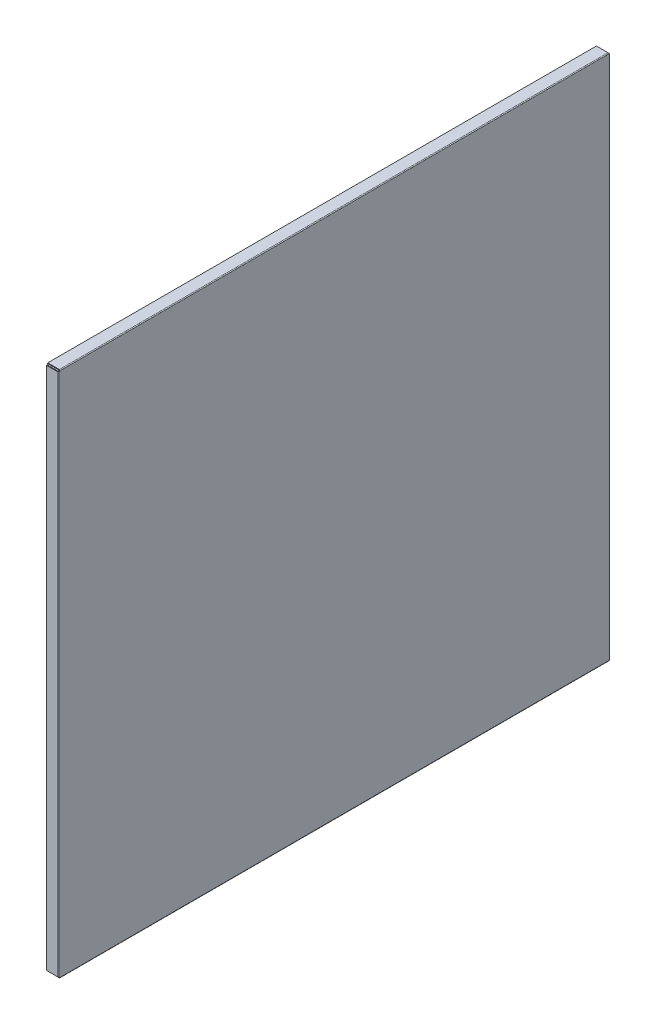
ISO-10303-21;
HEADER;
FILE_DESCRIPTION(('STEP AP214'),'2;1');
FILE_NAME('part.step','',(''),(''),'','','');
FILE_SCHEMA(('AUTOMOTIVE_DESIGN { 1 0 10303 214 1 1 1 1 }'));
ENDSEC;
DATA;
#1=APPLICATION_CONTEXT('core data for automotive mechanical design processes');
#2=APPLICATION_PROTOCOL_DEFINITION('international standard','automotive_design',2000,#1);
#3=PRODUCT_CONTEXT('',#1,'mechanical');
#4=PRODUCT('Part','Part','',(#3));
#5=PRODUCT_RELATED_PRODUCT_CATEGORY('part','',(#4));
#6=PRODUCT_DEFINITION_FORMATION('','',#4);
#7=PRODUCT_DEFINITION_CONTEXT('part definition',#1,'design');
#8=PRODUCT_DEFINITION('design','',#6,#7);
#9=PRODUCT_DEFINITION_SHAPE('','',#8);
#10=(LENGTH_UNIT() NAMED_UNIT(*) SI_UNIT(.MILLI.,.METRE.));
#11=(NAMED_UNIT(*) PLANE_ANGLE_UNIT() SI_UNIT($,.RADIAN.));
#12=(NAMED_UNIT(*) SI_UNIT($,.STERADIAN.) SOLID_ANGLE_UNIT());
#13=UNCERTAINTY_MEASURE_WITH_UNIT(LENGTH_MEASURE(1.E-05),#10,'distance_accuracy_value','');
#14=(GEOMETRIC_REPRESENTATION_CONTEXT(3) GLOBAL_UNCERTAINTY_ASSIGNED_CONTEXT((#13)) GLOBAL_UNIT_ASSIGNED_CONTEXT((#10,
#11,#12)) REPRESENTATION_CONTEXT('',''));
#15=CARTESIAN_POINT('',(0.,0.,0.));
#16=DIRECTION('',(0.,0.,1.));
#17=DIRECTION('',(1.,0.,0.));
#18=AXIS2_PLACEMENT_3D('',#15,#16,#17);
#19=CARTESIAN_POINT('',(599.,0.,0.));
#20=DIRECTION('',(-1.,0.,0.));
#21=DIRECTION('',(0.,0.,1.));
#22=AXIS2_PLACEMENT_3D('',#19,#20,#21);
#23=PLANE('',#22);
#24=DIRECTION('',(0.,1.,0.));
#25=VECTOR('',#24,1.);
#26=CARTESIAN_POINT('',(599.,-359.000000000004,-41.));
#27=LINE('',#26,#25);
#28=CARTESIAN_POINT('',(599.,-40.7071067811904,-41.));
#29=VERTEX_POINT('',#28);
#30=CARTESIAN_POINT('',(599.,-40.0000000000037,-41.));
#31=VERTEX_POINT('',#30);
#32=EDGE_CURVE('E433',#29,#31,#27,.T.);
#33=ORIENTED_EDGE('',*,*,#32,.T.);
#34=DIRECTION('',(0.,0.,-1.));
#35=VECTOR('',#34,1.);
#36=CARTESIAN_POINT('',(599.,-40.0000000000037,-375.));
#37=LINE('',#36,#35);
#38=CARTESIAN_POINT('',(599.,-40.0000000000037,-41.7071067811866));
#39=VERTEX_POINT('',#38);
#40=EDGE_CURVE('E571',#31,#39,#37,.T.);
#41=ORIENTED_EDGE('',*,*,#40,.T.);
#42=DIRECTION('',(0.,0.,-1.));
#43=VECTOR('',#42,1.);
#44=CARTESIAN_POINT('',(599.,-40.0000000000037,0.));
#45=LINE('',#44,#43);
#46=CARTESIAN_POINT('',(599.,-40.0000000000037,-708.292893218813));
#47=VERTEX_POINT('',#46);
#48=EDGE_CURVE('E565',#47,#39,#45,.F.);
#49=ORIENTED_EDGE('',*,*,#48,.F.);
#50=CARTESIAN_POINT('',(599.,-40.0000000000037,-709.));
#51=VERTEX_POINT('',#50);
#52=EDGE_CURVE('E426',#47,#51,#37,.T.);
#53=ORIENTED_EDGE('',*,*,#52,.T.);
#54=DIRECTION('',(0.,-1.,0.));
#55=VECTOR('',#54,1.);
#56=CARTESIAN_POINT('',(599.,-359.000000000004,-709.));
#57=LINE('',#56,#55);
#58=CARTESIAN_POINT('',(599.,-40.7071067811904,-709.));
#59=VERTEX_POINT('',#58);
#60=EDGE_CURVE('E814',#51,#59,#57,.T.);
#61=ORIENTED_EDGE('',*,*,#60,.T.);
#62=DIRECTION('',(0.,-1.,0.));
#63=VECTOR('',#62,1.);
#64=CARTESIAN_POINT('',(599.,1.22991894446756E-13,-709.));
#65=LINE('',#64,#63);
#66=CARTESIAN_POINT('',(599.,-677.292893218817,-709.));
#67=VERTEX_POINT('',#66);
#68=EDGE_CURVE('E779',#67,#59,#65,.F.);
#69=ORIENTED_EDGE('',*,*,#68,.F.);
#70=CARTESIAN_POINT('',(599.,-678.000000000004,-709.));
#71=VERTEX_POINT('',#70);
#72=EDGE_CURVE('E811',#67,#71,#57,.T.);
#73=ORIENTED_EDGE('',*,*,#72,.T.);
#74=DIRECTION('',(0.,0.,1.));
#75=VECTOR('',#74,1.);
#76=CARTESIAN_POINT('',(599.,-678.000000000004,-375.));
#77=LINE('',#76,#75);
#78=CARTESIAN_POINT('',(599.,-678.000000000004,-708.292893218813));
#79=VERTEX_POINT('',#78);
#80=EDGE_CURVE('E910',#71,#79,#77,.T.);
#81=ORIENTED_EDGE('',*,*,#80,.T.);
#82=DIRECTION('',(0.,0.,1.));
#83=VECTOR('',#82,1.);
#84=CARTESIAN_POINT('',(599.,-678.000000000004,-1.12347941894905E-13));
#85=LINE('',#84,#83);
#86=CARTESIAN_POINT('',(599.,-678.000000000004,-41.7071067811866));
#87=VERTEX_POINT('',#86);
#88=EDGE_CURVE('E701',#87,#79,#85,.F.);
#89=ORIENTED_EDGE('',*,*,#88,.F.);
#90=CARTESIAN_POINT('',(599.,-678.000000000004,-41.));
#91=VERTEX_POINT('',#90);
#92=EDGE_CURVE('E919',#87,#91,#77,.T.);
#93=ORIENTED_EDGE('',*,*,#92,.T.);
#94=CARTESIAN_POINT('',(599.,-677.292893218817,-41.));
#95=VERTEX_POINT('',#94);
#96=EDGE_CURVE('E1005',#91,#95,#27,.T.);
#97=ORIENTED_EDGE('',*,*,#96,.T.);
#98=DIRECTION('',(0.,1.,0.));
#99=VECTOR('',#98,1.);
#100=CARTESIAN_POINT('',(599.,0.,-41.));
#101=LINE('',#100,#99);
#102=EDGE_CURVE('E739',#29,#95,#101,.F.);
#103=ORIENTED_EDGE('',*,*,#102,.F.);
#104=EDGE_LOOP('',(#33,#41,#49,#53,#61,#69,#73,#81,#89,#93,#97,#103));
#105=FACE_BOUND('',#104,.T.);
#106=ADVANCED_FACE('F410',(#105),#23,.T.);
#107=CARTESIAN_POINT('',(600.,0.,0.));
#108=DIRECTION('',(-1.,0.,0.));
#109=DIRECTION('',(0.,0.,1.));
#110=AXIS2_PLACEMENT_3D('',#107,#108,#109);
#111=PLANE('',#110);
#112=DIRECTION('',(0.,0.,-1.));
#113=VECTOR('',#112,1.);
#114=CARTESIAN_POINT('',(600.,-40.0000000000037,-709.));
#115=LINE('',#114,#113);
#116=CARTESIAN_POINT('',(600.,-40.0000000000037,-41.0000000000001));
#117=VERTEX_POINT('',#116);
#118=CARTESIAN_POINT('',(600.,-40.0000000000038,-709.));
#119=VERTEX_POINT('',#118);
#120=EDGE_CURVE('E661',#117,#119,#115,.T.);
#121=ORIENTED_EDGE('',*,*,#120,.F.);
#122=DIRECTION('',(0.,1.,0.));
#123=VECTOR('',#122,1.);
#124=CARTESIAN_POINT('',(600.,-40.0000000000037,-41.));
#125=LINE('',#124,#123);
#126=CARTESIAN_POINT('',(600.,-678.000000000004,-41.));
#127=VERTEX_POINT('',#126);
#128=EDGE_CURVE('E1071',#127,#117,#125,.T.);
#129=ORIENTED_EDGE('',*,*,#128,.F.);
#130=DIRECTION('',(0.,0.,1.));
#131=VECTOR('',#130,1.);
#132=CARTESIAN_POINT('',(600.,-678.000000000004,-40.9999999999999));
#133=LINE('',#132,#131);
#134=CARTESIAN_POINT('',(600.,-678.000000000004,-709.));
#135=VERTEX_POINT('',#134);
#136=EDGE_CURVE('E921',#135,#127,#133,.T.);
#137=ORIENTED_EDGE('',*,*,#136,.F.);
#138=DIRECTION('',(0.,-1.,0.));
#139=VECTOR('',#138,1.);
#140=CARTESIAN_POINT('',(600.,-678.000000000004,-709.));
#141=LINE('',#140,#139);
#142=EDGE_CURVE('E419',#119,#135,#141,.T.);
#143=ORIENTED_EDGE('',*,*,#142,.F.);
#144=EDGE_LOOP('',(#121,#129,#137,#143));
#145=FACE_BOUND('',#144,.T.);
#146=ADVANCED_FACE('F412',(#145),#111,.F.);
#147=CARTESIAN_POINT('',(599.,-40.7071067811904,-709.));
#148=CARTESIAN_POINT('',(599.,-40.7071067811904,-709.333333333333));
#149=CARTESIAN_POINT('',(599.,-40.7071067811904,-709.666666666667));
#150=CARTESIAN_POINT('',(599.,-40.7071067811904,-710.));
#151=CARTESIAN_POINT('',(599.,-40.5892556509926,-709.));
#152=CARTESIAN_POINT('',(599.0872664626,-40.5892556509926,-709.333333333333));
#153=CARTESIAN_POINT('',(599.174532925199,-40.5892556509926,-709.666666666667));
#154=CARTESIAN_POINT('',(599.261799387799,-40.5892556509926,-710.));
#155=CARTESIAN_POINT('',(599.,-40.4714045207948,-709.));
#156=CARTESIAN_POINT('',(599.173995552921,-40.4714045207948,-709.29740896787));
#157=CARTESIAN_POINT('',(599.347991105842,-40.4714045207948,-709.59481793574));
#158=CARTESIAN_POINT('',(599.521986658763,-40.4714045207949,-709.89222690361));
#159=CARTESIAN_POINT('',(599.,-40.2357022603993,-709.));
#160=CARTESIAN_POINT('',(599.29740896787,-40.2357022603993,-709.173995552921));
#161=CARTESIAN_POINT('',(599.59481793574,-40.2357022603993,-709.347991105842));
#162=CARTESIAN_POINT('',(599.89222690361,-40.2357022603993,-709.521986658763));
#163=CARTESIAN_POINT('',(599.,-40.1178511302015,-709.));
#164=CARTESIAN_POINT('',(599.333333333333,-40.1178511302015,-709.0872664626));
#165=CARTESIAN_POINT('',(599.666666666667,-40.1178511302016,-709.1745329252));
#166=CARTESIAN_POINT('',(600.,-40.1178511302016,-709.261799387799));
#167=CARTESIAN_POINT('',(599.,-40.0000000000038,-709.));
#168=CARTESIAN_POINT('',(599.333333333333,-40.0000000000038,-709.));
#169=CARTESIAN_POINT('',(599.666666666667,-40.0000000000038,-709.));
#170=CARTESIAN_POINT('',(600.,-40.0000000000038,-709.));
#171=B_SPLINE_SURFACE_WITH_KNOTS('',3,3,((#147,#148,#149,#150),(#151,#152,#153,#154),(#155,#156,
#157,#158),(#159,#160,#161,#162),(#163,#164,#165,#166),(#167,#168,#169,#170)),.UNSPECIFIED.,.F.,
.F.,.F.,(4,2,4),(4,4),(0.,0.5,1.),(0.,1.),.UNSPECIFIED.);
#172=DIRECTION('',(-1.,0.,0.));
#173=VECTOR('',#172,1.);
#174=CARTESIAN_POINT('',(599.5,-40.0000000000038,-709.));
#175=LINE('',#174,#173);
#176=EDGE_CURVE('E578',#119,#51,#175,.T.);
#177=CARTESIAN_POINT('',(600.,-40.0000000000038,-709.));
#178=CARTESIAN_POINT('',(600.,-40.1178511302016,-709.261799387799));
#179=CARTESIAN_POINT('',(599.89222690361,-40.2357022603993,-709.521986658763));
#180=CARTESIAN_POINT('',(599.521986658763,-40.4714045207949,-709.89222690361));
#181=CARTESIAN_POINT('',(599.261799387799,-40.5892556509926,-710.));
#182=CARTESIAN_POINT('',(599.,-40.7071067811904,-710.));
#183=B_SPLINE_CURVE_WITH_KNOTS('',3,(#177,#178,#179,#180,#181,#182),.UNSPECIFIED.,.F.,.F.,(4,2,
4),(0.,0.5,1.),.UNSPECIFIED.);
#184=CARTESIAN_POINT('',(599.,-40.7071067811904,-710.));
#185=VERTEX_POINT('',#184);
#186=EDGE_CURVE('E873',#185,#119,#183,.F.);
#187=DIRECTION('',(0.,0.,-1.));
#188=VECTOR('',#187,1.);
#189=CARTESIAN_POINT('',(599.,-40.7071067811904,-709.));
#190=LINE('',#189,#188);
#191=EDGE_CURVE('E775',#59,#185,#190,.T.);
#192=ORIENTED_EDGE('',*,*,#60,.F.);
#193=ORIENTED_EDGE('',*,*,#176,.F.);
#194=ORIENTED_EDGE('',*,*,#186,.F.);
#195=ORIENTED_EDGE('',*,*,#191,.F.);
#196=EDGE_LOOP('',(#192,#193,#194,#195));
#197=FACE_BOUND('',#196,.T.);
#198=ADVANCED_FACE('F849',(#197),#171,.T.);
#199=CARTESIAN_POINT('',(599.,-677.292893218817,-709.));
#200=CARTESIAN_POINT('',(599.,-677.410744349015,-709.));
#201=CARTESIAN_POINT('',(599.,-677.528595479213,-709.));
#202=CARTESIAN_POINT('',(599.,-677.764297739608,-709.));
#203=CARTESIAN_POINT('',(599.,-677.882148869806,-709.));
#204=CARTESIAN_POINT('',(599.,-678.000000000004,-709.));
#205=CARTESIAN_POINT('',(599.,-677.292893218817,-710.));
#206=CARTESIAN_POINT('',(599.261799387799,-677.410744349015,-710.));
#207=CARTESIAN_POINT('',(599.521986658763,-677.528595479213,-709.89222690361));
#208=CARTESIAN_POINT('',(599.89222690361,-677.764297739608,-709.521986658764));
#209=CARTESIAN_POINT('',(600.,-677.882148869806,-709.261799387799));
#210=CARTESIAN_POINT('',(600.,-678.000000000004,-709.));
#211=B_SPLINE_SURFACE_WITH_KNOTS('',1,3,((#199,#200,#201,#202,#203,#204),(#205,#206,#207,#208,
#209,#210)),.UNSPECIFIED.,.F.,.F.,.F.,(2,2),(4,2,4),(0.,1.),(0.,0.5,1.),.UNSPECIFIED.);
#212=DIRECTION('',(0.,0.,1.));
#213=VECTOR('',#212,1.);
#214=CARTESIAN_POINT('',(599.,-677.292893218817,-710.));
#215=LINE('',#214,#213);
#216=CARTESIAN_POINT('',(599.,-677.292893218817,-710.));
#217=VERTEX_POINT('',#216);
#218=EDGE_CURVE('E787',#67,#217,#215,.F.);
#219=CARTESIAN_POINT('',(599.,-677.292893218817,-710.));
#220=CARTESIAN_POINT('',(599.261799387799,-677.410744349015,-710.));
#221=CARTESIAN_POINT('',(599.521986658763,-677.528595479213,-709.89222690361));
#222=CARTESIAN_POINT('',(599.89222690361,-677.764297739608,-709.521986658764));
#223=CARTESIAN_POINT('',(600.,-677.882148869806,-709.261799387799));
#224=CARTESIAN_POINT('',(600.,-678.000000000004,-709.));
#225=B_SPLINE_CURVE_WITH_KNOTS('',3,(#219,#220,#221,#222,#223,#224),.UNSPECIFIED.,.F.,.F.,(4,2,
4),(0.,0.5,1.),.UNSPECIFIED.);
#226=EDGE_CURVE('E14',#135,#217,#225,.F.);
#227=DIRECTION('',(1.,0.,0.));
#228=VECTOR('',#227,1.);
#229=CARTESIAN_POINT('',(599.5,-678.000000000004,-709.));
#230=LINE('',#229,#228);
#231=EDGE_CURVE('E875',#71,#135,#230,.T.);
#232=ORIENTED_EDGE('',*,*,#218,.T.);
#233=ORIENTED_EDGE('',*,*,#226,.F.);
#234=ORIENTED_EDGE('',*,*,#231,.F.);
#235=ORIENTED_EDGE('',*,*,#72,.F.);
#236=EDGE_LOOP('',(#232,#233,#234,#235));
#237=FACE_BOUND('',#236,.T.);
#238=ADVANCED_FACE('F840',(#237),#211,.T.);
#239=CARTESIAN_POINT('',(599.,-678.000000000004,-709.));
#240=DIRECTION('',(0.,-1.,0.));
#241=DIRECTION('',(0.,0.,-1.));
#242=AXIS2_PLACEMENT_3D('',#239,#240,#241);
#243=CYLINDRICAL_SURFACE('',#242,1.);
#244=ORIENTED_EDGE('',*,*,#142,.T.);
#245=ORIENTED_EDGE('',*,*,#226,.T.);
#246=DIRECTION('',(0.,1.,0.));
#247=VECTOR('',#246,1.);
#248=CARTESIAN_POINT('',(599.,-39.0000000000037,-710.));
#249=LINE('',#248,#247);
#250=EDGE_CURVE('E799',#217,#185,#249,.T.);
#251=ORIENTED_EDGE('',*,*,#250,.T.);
#252=ORIENTED_EDGE('',*,*,#186,.T.);
#253=EDGE_LOOP('',(#244,#245,#251,#252));
#254=FACE_BOUND('',#253,.T.);
#255=ADVANCED_FACE('F829',(#254),#243,.T.);
#256=CARTESIAN_POINT('',(585.,-679.000000000004,-710.));
#257=DIRECTION('',(-1.,0.,0.));
#258=DIRECTION('',(0.,0.,1.));
#259=AXIS2_PLACEMENT_3D('',#256,#257,#258);
#260=PLANE('',#259);
#261=DIRECTION('',(0.,0.,1.));
#262=VECTOR('',#261,1.);
#263=CARTESIAN_POINT('',(585.,-677.292893218817,-709.));
#264=LINE('',#263,#262);
#265=CARTESIAN_POINT('',(585.,-677.292893218817,-709.));
#266=VERTEX_POINT('',#265);
#267=CARTESIAN_POINT('',(585.,-677.292893218817,-710.));
#268=VERTEX_POINT('',#267);
#269=EDGE_CURVE('E776',#266,#268,#264,.F.);
#270=ORIENTED_EDGE('',*,*,#269,.F.);
#271=DIRECTION('',(0.,1.,0.));
#272=VECTOR('',#271,1.);
#273=CARTESIAN_POINT('',(585.,1.22991894446756E-13,-709.));
#274=LINE('',#273,#272);
#275=CARTESIAN_POINT('',(585.,-40.7071067811904,-709.));
#276=VERTEX_POINT('',#275);
#277=EDGE_CURVE('E781',#276,#266,#274,.F.);
#278=ORIENTED_EDGE('',*,*,#277,.F.);
#279=DIRECTION('',(0.,0.,-1.));
#280=VECTOR('',#279,1.);
#281=CARTESIAN_POINT('',(585.,-40.7071067811904,-710.));
#282=LINE('',#281,#280);
#283=CARTESIAN_POINT('',(585.,-40.7071067811904,-710.));
#284=VERTEX_POINT('',#283);
#285=EDGE_CURVE('E782',#276,#284,#282,.T.);
#286=ORIENTED_EDGE('',*,*,#285,.T.);
#287=DIRECTION('',(0.,-1.,0.));
#288=VECTOR('',#287,1.);
#289=CARTESIAN_POINT('',(585.,-679.000000000004,-710.));
#290=LINE('',#289,#288);
#291=EDGE_CURVE('E802',#284,#268,#290,.T.);
#292=ORIENTED_EDGE('',*,*,#291,.T.);
#293=EDGE_LOOP('',(#270,#278,#286,#292));
#294=FACE_BOUND('',#293,.T.);
#295=ADVANCED_FACE('F839',(#294),#260,.T.);
#296=CARTESIAN_POINT('',(5.63390824908074E-12,1.23165366794354E-13,-710.000000000005));
#297=DIRECTION('',(0.,0.,-1.));
#298=DIRECTION('',(-1.,0.,0.));
#299=AXIS2_PLACEMENT_3D('',#296,#297,#298);
#300=PLANE('',#299);
#301=DIRECTION('',(-1.,0.,0.));
#302=VECTOR('',#301,1.);
#303=CARTESIAN_POINT('',(599.,-677.292893218817,-710.));
#304=LINE('',#303,#302);
#305=EDGE_CURVE('E793',#268,#217,#304,.F.);
#306=ORIENTED_EDGE('',*,*,#305,.F.);
#307=ORIENTED_EDGE('',*,*,#291,.F.);
#308=DIRECTION('',(1.,0.,0.));
#309=VECTOR('',#308,1.);
#310=CARTESIAN_POINT('',(5.63390824908074E-12,-40.7071067811904,-710.000000000005));
#311=LINE('',#310,#309);
#312=EDGE_CURVE('E805',#284,#185,#311,.T.);
#313=ORIENTED_EDGE('',*,*,#312,.T.);
#314=ORIENTED_EDGE('',*,*,#250,.F.);
#315=EDGE_LOOP('',(#306,#307,#313,#314));
#316=FACE_BOUND('',#315,.T.);
#317=ADVANCED_FACE('F890',(#316),#300,.T.);
#318=CARTESIAN_POINT('',(5.6304167677419E-12,1.22991894446756E-13,-709.000000000005));
#319=DIRECTION('',(0.,0.,-1.));
#320=DIRECTION('',(-1.,0.,0.));
#321=AXIS2_PLACEMENT_3D('',#318,#319,#320);
#322=PLANE('',#321);
#323=ORIENTED_EDGE('',*,*,#277,.T.);
#324=DIRECTION('',(-1.,0.,0.));
#325=VECTOR('',#324,1.);
#326=CARTESIAN_POINT('',(599.,-677.292893218817,-709.));
#327=LINE('',#326,#325);
#328=EDGE_CURVE('E785',#67,#266,#327,.T.);
#329=ORIENTED_EDGE('',*,*,#328,.F.);
#330=ORIENTED_EDGE('',*,*,#68,.T.);
#331=DIRECTION('',(1.,0.,0.));
#332=VECTOR('',#331,1.);
#333=CARTESIAN_POINT('',(5.6304167677419E-12,-40.7071067811904,-709.000000000005));
#334=LINE('',#333,#332);
#335=EDGE_CURVE('E773',#59,#276,#334,.F.);
#336=ORIENTED_EDGE('',*,*,#335,.T.);
#337=EDGE_LOOP('',(#323,#329,#330,#336));
#338=FACE_BOUND('',#337,.T.);
#339=ADVANCED_FACE('F904',(#338),#322,.F.);
#340=CARTESIAN_POINT('',(599.,-40.7071067811904,-709.));
#341=DIRECTION('',(0.,1.,0.));
#342=DIRECTION('',(-1.,0.,0.));
#343=AXIS2_PLACEMENT_3D('',#340,#341,#342);
#344=PLANE('',#343);
#345=ORIENTED_EDGE('',*,*,#285,.F.);
#346=ORIENTED_EDGE('',*,*,#335,.F.);
#347=ORIENTED_EDGE('',*,*,#191,.T.);
#348=ORIENTED_EDGE('',*,*,#312,.F.);
#349=EDGE_LOOP('',(#345,#346,#347,#348));
#350=FACE_BOUND('',#349,.T.);
#351=ADVANCED_FACE('F1053',(#350),#344,.T.);
#352=CARTESIAN_POINT('',(599.,-677.292893218817,-709.));
#353=DIRECTION('',(0.,1.,0.));
#354=DIRECTION('',(-1.,0.,0.));
#355=AXIS2_PLACEMENT_3D('',#352,#353,#354);
#356=PLANE('',#355);
#357=ORIENTED_EDGE('',*,*,#328,.T.);
#358=ORIENTED_EDGE('',*,*,#269,.T.);
#359=ORIENTED_EDGE('',*,*,#305,.T.);
#360=ORIENTED_EDGE('',*,*,#218,.F.);
#361=EDGE_LOOP('',(#357,#358,#359,#360));
#362=FACE_BOUND('',#361,.T.);
#363=ADVANCED_FACE('F899',(#362),#356,.F.);
#364=CARTESIAN_POINT('',(599.,-677.292893218817,-41.));
#365=CARTESIAN_POINT('',(599.,-677.292893218817,-40.6666666666667));
#366=CARTESIAN_POINT('',(599.,-677.292893218817,-40.3333333333333));
#367=CARTESIAN_POINT('',(599.,-677.292893218817,-40.));
#368=CARTESIAN_POINT('',(599.,-677.410744349015,-41.));
#369=CARTESIAN_POINT('',(599.0872664626,-677.410744349015,-40.6666666666667));
#370=CARTESIAN_POINT('',(599.174532925199,-677.410744349015,-40.3333333333333));
#371=CARTESIAN_POINT('',(599.261799387799,-677.410744349015,-40.));
#372=CARTESIAN_POINT('',(599.,-677.528595479213,-41.));
#373=CARTESIAN_POINT('',(599.173995552921,-677.528595479213,-40.70259103213));
#374=CARTESIAN_POINT('',(599.347991105842,-677.528595479213,-40.4051820642601));
#375=CARTESIAN_POINT('',(599.521986658763,-677.528595479213,-40.1077730963902));
#376=CARTESIAN_POINT('',(599.,-677.764297739608,-41.));
#377=CARTESIAN_POINT('',(599.29740896787,-677.764297739608,-40.8260044470789));
#378=CARTESIAN_POINT('',(599.59481793574,-677.764297739608,-40.6520088941578));
#379=CARTESIAN_POINT('',(599.89222690361,-677.764297739608,-40.4780133412367));
#380=CARTESIAN_POINT('',(599.,-677.882148869806,-41.));
#381=CARTESIAN_POINT('',(599.333333333333,-677.882148869806,-40.9127335374003));
#382=CARTESIAN_POINT('',(599.666666666667,-677.882148869806,-40.8254670748005));
#383=CARTESIAN_POINT('',(600.,-677.882148869806,-40.7382006122008));
#384=CARTESIAN_POINT('',(599.,-678.000000000004,-41.));
#385=CARTESIAN_POINT('',(599.333333333333,-678.000000000004,-41.));
#386=CARTESIAN_POINT('',(599.666666666667,-678.000000000004,-41.));
#387=CARTESIAN_POINT('',(600.,-678.000000000004,-41.));
#388=B_SPLINE_SURFACE_WITH_KNOTS('',3,3,((#364,#365,#366,#367),(#368,#369,#370,#371),(#372,#373,
#374,#375),(#376,#377,#378,#379),(#380,#381,#382,#383),(#384,#385,#386,#387)),.UNSPECIFIED.,.F.,
.F.,.F.,(4,2,4),(4,4),(0.,0.5,1.),(0.,1.),.UNSPECIFIED.);
#389=DIRECTION('',(-1.,0.,0.));
#390=VECTOR('',#389,1.);
#391=CARTESIAN_POINT('',(599.5,-678.000000000004,-41.));
#392=LINE('',#391,#390);
#393=EDGE_CURVE('E1011',#127,#91,#392,.T.);
#394=CARTESIAN_POINT('',(600.,-678.000000000004,-41.));
#395=CARTESIAN_POINT('',(600.,-677.882148869806,-40.7382006122008));
#396=CARTESIAN_POINT('',(599.89222690361,-677.764297739608,-40.4780133412367));
#397=CARTESIAN_POINT('',(599.521986658763,-677.528595479213,-40.1077730963902));
#398=CARTESIAN_POINT('',(599.261799387799,-677.410744349015,-40.));
#399=CARTESIAN_POINT('',(599.,-677.292893218817,-40.));
#400=B_SPLINE_CURVE_WITH_KNOTS('',3,(#394,#395,#396,#397,#398,#399),.UNSPECIFIED.,.F.,.F.,(4,2,
4),(0.,0.5,1.),.UNSPECIFIED.);
#401=CARTESIAN_POINT('',(599.,-677.292893218817,-40.));
#402=VERTEX_POINT('',#401);
#403=EDGE_CURVE('E1015',#402,#127,#400,.F.);
#404=DIRECTION('',(0.,0.,1.));
#405=VECTOR('',#404,1.);
#406=CARTESIAN_POINT('',(599.,-677.292893218817,-41.));
#407=LINE('',#406,#405);
#408=EDGE_CURVE('E735',#95,#402,#407,.T.);
#409=ORIENTED_EDGE('',*,*,#96,.F.);
#410=ORIENTED_EDGE('',*,*,#393,.F.);
#411=ORIENTED_EDGE('',*,*,#403,.F.);
#412=ORIENTED_EDGE('',*,*,#408,.F.);
#413=EDGE_LOOP('',(#409,#410,#411,#412));
#414=FACE_BOUND('',#413,.T.);
#415=ADVANCED_FACE('F1009',(#414),#388,.T.);
#416=CARTESIAN_POINT('',(599.,-40.7071067811904,-41.));
#417=CARTESIAN_POINT('',(599.,-40.5892556509926,-41.));
#418=CARTESIAN_POINT('',(599.,-40.4714045207948,-41.));
#419=CARTESIAN_POINT('',(599.,-40.2357022603993,-41.));
#420=CARTESIAN_POINT('',(599.,-40.1178511302015,-41.));
#421=CARTESIAN_POINT('',(599.,-40.0000000000037,-41.));
#422=CARTESIAN_POINT('',(599.,-40.7071067811904,-40.));
#423=CARTESIAN_POINT('',(599.261799387799,-40.5892556509926,-40.));
#424=CARTESIAN_POINT('',(599.521986658763,-40.4714045207948,-40.1077730963902));
#425=CARTESIAN_POINT('',(599.89222690361,-40.2357022603993,-40.4780133412367));
#426=CARTESIAN_POINT('',(600.,-40.1178511302015,-40.7382006122008));
#427=CARTESIAN_POINT('',(600.,-40.0000000000037,-41.));
#428=B_SPLINE_SURFACE_WITH_KNOTS('',1,3,((#416,#417,#418,#419,#420,#421),(#422,#423,#424,#425,
#426,#427)),.UNSPECIFIED.,.F.,.F.,.F.,(2,2),(4,2,4),(0.,1.),(0.,0.5,1.),.UNSPECIFIED.);
#429=DIRECTION('',(0.,0.,-1.));
#430=VECTOR('',#429,1.);
#431=CARTESIAN_POINT('',(599.,-40.7071067811904,-40.));
#432=LINE('',#431,#430);
#433=CARTESIAN_POINT('',(599.,-40.7071067811904,-40.));
#434=VERTEX_POINT('',#433);
#435=EDGE_CURVE('E747',#29,#434,#432,.F.);
#436=CARTESIAN_POINT('',(599.,-40.7071067811904,-40.));
#437=CARTESIAN_POINT('',(599.261799387799,-40.5892556509926,-40.));
#438=CARTESIAN_POINT('',(599.521986658763,-40.4714045207948,-40.1077730963902));
#439=CARTESIAN_POINT('',(599.89222690361,-40.2357022603993,-40.4780133412367));
#440=CARTESIAN_POINT('',(600.,-40.1178511302015,-40.7382006122008));
#441=CARTESIAN_POINT('',(600.,-40.0000000000037,-41.));
#442=B_SPLINE_CURVE_WITH_KNOTS('',3,(#436,#437,#438,#439,#440,#441),.UNSPECIFIED.,.F.,.F.,(4,2,
4),(0.,0.5,1.),.UNSPECIFIED.);
#443=EDGE_CURVE('E788',#117,#434,#442,.F.);
#444=DIRECTION('',(1.,0.,0.));
#445=VECTOR('',#444,1.);
#446=CARTESIAN_POINT('',(599.5,-40.0000000000037,-41.));
#447=LINE('',#446,#445);
#448=EDGE_CURVE('E660',#31,#117,#447,.T.);
#449=ORIENTED_EDGE('',*,*,#435,.T.);
#450=ORIENTED_EDGE('',*,*,#443,.F.);
#451=ORIENTED_EDGE('',*,*,#448,.F.);
#452=ORIENTED_EDGE('',*,*,#32,.F.);
#453=EDGE_LOOP('',(#449,#450,#451,#452));
#454=FACE_BOUND('',#453,.T.);
#455=ADVANCED_FACE('F1040',(#454),#428,.T.);
#456=CARTESIAN_POINT('',(599.,-40.0000000000037,-41.));
#457=DIRECTION('',(0.,1.,0.));
#458=DIRECTION('',(0.,0.,1.));
#459=AXIS2_PLACEMENT_3D('',#456,#457,#458);
#460=CYLINDRICAL_SURFACE('',#459,1.);
#461=ORIENTED_EDGE('',*,*,#128,.T.);
#462=ORIENTED_EDGE('',*,*,#443,.T.);
#463=DIRECTION('',(0.,-1.,0.));
#464=VECTOR('',#463,1.);
#465=CARTESIAN_POINT('',(599.,-679.000000000004,-40.));
#466=LINE('',#465,#464);
#467=EDGE_CURVE('E759',#434,#402,#466,.T.);
#468=ORIENTED_EDGE('',*,*,#467,.T.);
#469=ORIENTED_EDGE('',*,*,#403,.T.);
#470=EDGE_LOOP('',(#461,#462,#468,#469));
#471=FACE_BOUND('',#470,.T.);
#472=ADVANCED_FACE('F1054',(#471),#460,.T.);
#473=CARTESIAN_POINT('',(585.,-39.0000000000037,-39.9999999999999));
#474=DIRECTION('',(-1.,0.,0.));
#475=DIRECTION('',(0.,0.,1.));
#476=AXIS2_PLACEMENT_3D('',#473,#474,#475);
#477=PLANE('',#476);
#478=DIRECTION('',(0.,0.,-1.));
#479=VECTOR('',#478,1.);
#480=CARTESIAN_POINT('',(585.,-40.7071067811904,-40.9999999999999));
#481=LINE('',#480,#479);
#482=CARTESIAN_POINT('',(585.,-40.7071067811904,-40.9999999999999));
#483=VERTEX_POINT('',#482);
#484=CARTESIAN_POINT('',(585.,-40.7071067811904,-39.9999999999999));
#485=VERTEX_POINT('',#484);
#486=EDGE_CURVE('E736',#483,#485,#481,.F.);
#487=ORIENTED_EDGE('',*,*,#486,.F.);
#488=DIRECTION('',(0.,-1.,0.));
#489=VECTOR('',#488,1.);
#490=CARTESIAN_POINT('',(585.,0.,-40.9999999999999));
#491=LINE('',#490,#489);
#492=CARTESIAN_POINT('',(585.,-677.292893218817,-40.9999999999999));
#493=VERTEX_POINT('',#492);
#494=EDGE_CURVE('E741',#493,#483,#491,.F.);
#495=ORIENTED_EDGE('',*,*,#494,.F.);
#496=DIRECTION('',(0.,0.,1.));
#497=VECTOR('',#496,1.);
#498=CARTESIAN_POINT('',(585.,-677.292893218817,-39.9999999999999));
#499=LINE('',#498,#497);
#500=CARTESIAN_POINT('',(585.,-677.292893218817,-39.9999999999999));
#501=VERTEX_POINT('',#500);
#502=EDGE_CURVE('E742',#493,#501,#499,.T.);
#503=ORIENTED_EDGE('',*,*,#502,.T.);
#504=DIRECTION('',(0.,1.,0.));
#505=VECTOR('',#504,1.);
#506=CARTESIAN_POINT('',(585.,-39.0000000000037,-39.9999999999999));
#507=LINE('',#506,#505);
#508=EDGE_CURVE('E762',#501,#485,#507,.T.);
#509=ORIENTED_EDGE('',*,*,#508,.T.);
#510=EDGE_LOOP('',(#487,#495,#503,#509));
#511=FACE_BOUND('',#510,.T.);
#512=ADVANCED_FACE('F1041',(#511),#477,.T.);
#513=CARTESIAN_POINT('',(-1.35286396739294E-13,0.,-39.9999999999979));
#514=DIRECTION('',(0.,0.,1.));
#515=DIRECTION('',(1.,0.,0.));
#516=AXIS2_PLACEMENT_3D('',#513,#514,#515);
#517=PLANE('',#516);
#518=DIRECTION('',(-1.,0.,0.));
#519=VECTOR('',#518,1.);
#520=CARTESIAN_POINT('',(599.,-40.7071067811904,-40.));
#521=LINE('',#520,#519);
#522=EDGE_CURVE('E753',#485,#434,#521,.F.);
#523=ORIENTED_EDGE('',*,*,#522,.F.);
#524=ORIENTED_EDGE('',*,*,#508,.F.);
#525=DIRECTION('',(1.,0.,0.));
#526=VECTOR('',#525,1.);
#527=CARTESIAN_POINT('',(-1.35286396739294E-13,-677.292893218817,-39.9999999999979));
#528=LINE('',#527,#526);
#529=EDGE_CURVE('E765',#501,#402,#528,.T.);
#530=ORIENTED_EDGE('',*,*,#529,.T.);
#531=ORIENTED_EDGE('',*,*,#467,.F.);
#532=EDGE_LOOP('',(#523,#524,#530,#531));
#533=FACE_BOUND('',#532,.T.);
#534=ADVANCED_FACE('F1115',(#533),#517,.T.);
#535=CARTESIAN_POINT('',(-1.38777878078137E-13,0.,-40.9999999999979));
#536=DIRECTION('',(0.,0.,1.));
#537=DIRECTION('',(1.,0.,0.));
#538=AXIS2_PLACEMENT_3D('',#535,#536,#537);
#539=PLANE('',#538);
#540=ORIENTED_EDGE('',*,*,#494,.T.);
#541=DIRECTION('',(-1.,0.,0.));
#542=VECTOR('',#541,1.);
#543=CARTESIAN_POINT('',(599.,-40.7071067811904,-41.));
#544=LINE('',#543,#542);
#545=EDGE_CURVE('E745',#29,#483,#544,.T.);
#546=ORIENTED_EDGE('',*,*,#545,.F.);
#547=ORIENTED_EDGE('',*,*,#102,.T.);
#548=DIRECTION('',(1.,0.,0.));
#549=VECTOR('',#548,1.);
#550=CARTESIAN_POINT('',(-1.38777878078137E-13,-677.292893218817,-40.9999999999979));
#551=LINE('',#550,#549);
#552=EDGE_CURVE('E733',#95,#493,#551,.F.);
#553=ORIENTED_EDGE('',*,*,#552,.T.);
#554=EDGE_LOOP('',(#540,#546,#547,#553));
#555=FACE_BOUND('',#554,.T.);
#556=ADVANCED_FACE('F1117',(#555),#539,.F.);
#557=CARTESIAN_POINT('',(599.,-677.292893218817,-41.));
#558=DIRECTION('',(0.,-1.,0.));
#559=DIRECTION('',(0.,0.,-1.));
#560=AXIS2_PLACEMENT_3D('',#557,#558,#559);
#561=PLANE('',#560);
#562=ORIENTED_EDGE('',*,*,#502,.F.);
#563=ORIENTED_EDGE('',*,*,#552,.F.);
#564=ORIENTED_EDGE('',*,*,#408,.T.);
#565=ORIENTED_EDGE('',*,*,#529,.F.);
#566=EDGE_LOOP('',(#562,#563,#564,#565));
#567=FACE_BOUND('',#566,.T.);
#568=ADVANCED_FACE('F1120',(#567),#561,.T.);
#569=CARTESIAN_POINT('',(599.,-40.7071067811904,-41.));
#570=DIRECTION('',(0.,-1.,0.));
#571=DIRECTION('',(0.,0.,-1.));
#572=AXIS2_PLACEMENT_3D('',#569,#570,#571);
#573=PLANE('',#572);
#574=ORIENTED_EDGE('',*,*,#545,.T.);
#575=ORIENTED_EDGE('',*,*,#486,.T.);
#576=ORIENTED_EDGE('',*,*,#522,.T.);
#577=ORIENTED_EDGE('',*,*,#435,.F.);
#578=EDGE_LOOP('',(#574,#575,#576,#577));
#579=FACE_BOUND('',#578,.T.);
#580=ADVANCED_FACE('F956',(#579),#573,.F.);
#581=CARTESIAN_POINT('',(599.,-678.000000000004,-708.292893218813));
#582=CARTESIAN_POINT('',(599.,-678.333333333337,-708.292893218813));
#583=CARTESIAN_POINT('',(599.,-678.66666666667,-708.292893218813));
#584=CARTESIAN_POINT('',(599.,-679.000000000004,-708.292893218813));
#585=CARTESIAN_POINT('',(599.,-678.000000000004,-708.410744349011));
#586=CARTESIAN_POINT('',(599.0872664626,-678.333333333337,-708.410744349011));
#587=CARTESIAN_POINT('',(599.174532925199,-678.66666666667,-708.410744349011));
#588=CARTESIAN_POINT('',(599.261799387799,-679.000000000004,-708.410744349011));
#589=CARTESIAN_POINT('',(599.,-678.000000000004,-708.528595479209));
#590=CARTESIAN_POINT('',(599.173995552921,-678.297408967874,-708.528595479209));
#591=CARTESIAN_POINT('',(599.347991105842,-678.594817935744,-708.528595479209));
#592=CARTESIAN_POINT('',(599.521986658763,-678.892226903614,-708.528595479209));
#593=CARTESIAN_POINT('',(599.,-678.000000000004,-708.764297739604));
#594=CARTESIAN_POINT('',(599.29740896787,-678.173995552925,-708.764297739604));
#595=CARTESIAN_POINT('',(599.59481793574,-678.347991105846,-708.764297739604));
#596=CARTESIAN_POINT('',(599.89222690361,-678.521986658767,-708.764297739604));
#597=CARTESIAN_POINT('',(599.,-678.000000000004,-708.882148869802));
#598=CARTESIAN_POINT('',(599.333333333333,-678.087266462604,-708.882148869802));
#599=CARTESIAN_POINT('',(599.666666666667,-678.174532925203,-708.882148869802));
#600=CARTESIAN_POINT('',(600.,-678.261799387803,-708.882148869802));
#601=CARTESIAN_POINT('',(599.,-678.000000000004,-709.));
#602=CARTESIAN_POINT('',(599.333333333333,-678.000000000004,-709.));
#603=CARTESIAN_POINT('',(599.666666666667,-678.000000000004,-709.));
#604=CARTESIAN_POINT('',(600.,-678.000000000004,-709.));
#605=B_SPLINE_SURFACE_WITH_KNOTS('',3,3,((#581,#582,#583,#584),(#585,#586,#587,#588),(#589,#590,
#591,#592),(#593,#594,#595,#596),(#597,#598,#599,#600),(#601,#602,#603,#604)),.UNSPECIFIED.,.F.,
.F.,.F.,(4,2,4),(4,4),(0.,0.5,1.),(0.,1.),.UNSPECIFIED.);
#606=CARTESIAN_POINT('',(600.,-678.000000000004,-709.));
#607=CARTESIAN_POINT('',(600.,-678.261799387803,-708.882148869802));
#608=CARTESIAN_POINT('',(599.89222690361,-678.521986658767,-708.764297739604));
#609=CARTESIAN_POINT('',(599.521986658763,-678.892226903614,-708.528595479209));
#610=CARTESIAN_POINT('',(599.261799387799,-679.000000000004,-708.410744349011));
#611=CARTESIAN_POINT('',(599.,-679.000000000004,-708.292893218813));
#612=B_SPLINE_CURVE_WITH_KNOTS('',3,(#606,#607,#608,#609,#610,#611),.UNSPECIFIED.,.F.,.F.,(4,2,
4),(0.,0.5,1.),.UNSPECIFIED.);
#613=CARTESIAN_POINT('',(599.,-679.000000000004,-708.292893218813));
#614=VERTEX_POINT('',#613);
#615=EDGE_CURVE('E918',#614,#135,#612,.F.);
#616=DIRECTION('',(0.,-1.,0.));
#617=VECTOR('',#616,1.);
#618=CARTESIAN_POINT('',(599.,-678.000000000004,-708.292893218813));
#619=LINE('',#618,#617);
#620=EDGE_CURVE('E697',#79,#614,#619,.T.);
#621=ORIENTED_EDGE('',*,*,#80,.F.);
#622=ORIENTED_EDGE('',*,*,#231,.T.);
#623=ORIENTED_EDGE('',*,*,#615,.F.);
#624=ORIENTED_EDGE('',*,*,#620,.F.);
#625=EDGE_LOOP('',(#621,#622,#623,#624));
#626=FACE_BOUND('',#625,.T.);
#627=ADVANCED_FACE('F917',(#626),#605,.T.);
#628=CARTESIAN_POINT('',(599.,-678.000000000004,-41.7071067811866));
#629=CARTESIAN_POINT('',(599.,-678.000000000004,-41.5892556509888));
#630=CARTESIAN_POINT('',(599.,-678.000000000004,-41.471404520791));
#631=CARTESIAN_POINT('',(599.,-678.000000000004,-41.2357022603955));
#632=CARTESIAN_POINT('',(599.,-678.000000000004,-41.1178511301977));
#633=CARTESIAN_POINT('',(599.,-678.000000000004,-40.9999999999999));
#634=CARTESIAN_POINT('',(599.,-679.000000000004,-41.7071067811866));
#635=CARTESIAN_POINT('',(599.261799387799,-679.000000000004,-41.5892556509888));
#636=CARTESIAN_POINT('',(599.521986658763,-678.892226903614,-41.471404520791));
#637=CARTESIAN_POINT('',(599.89222690361,-678.521986658767,-41.2357022603955));
#638=CARTESIAN_POINT('',(600.,-678.261799387803,-41.1178511301977));
#639=CARTESIAN_POINT('',(600.,-678.000000000004,-40.9999999999999));
#640=B_SPLINE_SURFACE_WITH_KNOTS('',1,3,((#628,#629,#630,#631,#632,#633),(#634,#635,#636,#637,
#638,#639)),.UNSPECIFIED.,.F.,.F.,.F.,(2,2),(4,2,4),(0.,1.),(0.,0.5,1.),.UNSPECIFIED.);
#641=DIRECTION('',(0.,1.,0.));
#642=VECTOR('',#641,1.);
#643=CARTESIAN_POINT('',(599.,-679.000000000004,-41.7071067811866));
#644=LINE('',#643,#642);
#645=CARTESIAN_POINT('',(599.,-679.000000000004,-41.7071067811866));
#646=VERTEX_POINT('',#645);
#647=EDGE_CURVE('E709',#87,#646,#644,.F.);
#648=CARTESIAN_POINT('',(599.,-679.000000000004,-41.7071067811866));
#649=CARTESIAN_POINT('',(599.261799387799,-679.000000000004,-41.5892556509888));
#650=CARTESIAN_POINT('',(599.521986658763,-678.892226903614,-41.471404520791));
#651=CARTESIAN_POINT('',(599.89222690361,-678.521986658767,-41.2357022603955));
#652=CARTESIAN_POINT('',(600.,-678.261799387803,-41.1178511301977));
#653=CARTESIAN_POINT('',(600.,-678.000000000004,-40.9999999999999));
#654=B_SPLINE_CURVE_WITH_KNOTS('',3,(#648,#649,#650,#651,#652,#653),.UNSPECIFIED.,.F.,.F.,(4,2,
4),(0.,0.5,1.),.UNSPECIFIED.);
#655=EDGE_CURVE('E748',#127,#646,#654,.F.);
#656=ORIENTED_EDGE('',*,*,#647,.T.);
#657=ORIENTED_EDGE('',*,*,#655,.F.);
#658=ORIENTED_EDGE('',*,*,#393,.T.);
#659=ORIENTED_EDGE('',*,*,#92,.F.);
#660=EDGE_LOOP('',(#656,#657,#658,#659));
#661=FACE_BOUND('',#660,.T.);
#662=ADVANCED_FACE('F954',(#661),#640,.T.);
#663=CARTESIAN_POINT('',(599.,-678.000000000004,-40.9999999999999));
#664=DIRECTION('',(0.,0.,1.));
#665=DIRECTION('',(0.,-1.,0.));
#666=AXIS2_PLACEMENT_3D('',#663,#664,#665);
#667=CYLINDRICAL_SURFACE('',#666,1.);
#668=ORIENTED_EDGE('',*,*,#136,.T.);
#669=ORIENTED_EDGE('',*,*,#655,.T.);
#670=DIRECTION('',(0.,0.,-1.));
#671=VECTOR('',#670,1.);
#672=CARTESIAN_POINT('',(599.,-679.000000000004,-710.));
#673=LINE('',#672,#671);
#674=EDGE_CURVE('E720',#646,#614,#673,.T.);
#675=ORIENTED_EDGE('',*,*,#674,.T.);
#676=ORIENTED_EDGE('',*,*,#615,.T.);
#677=EDGE_LOOP('',(#668,#669,#675,#676));
#678=FACE_BOUND('',#677,.T.);
#679=ADVANCED_FACE('F943',(#678),#667,.T.);
#680=CARTESIAN_POINT('',(585.,-679.000000000004,-40.));
#681=DIRECTION('',(-1.,0.,0.));
#682=DIRECTION('',(0.,-1.,0.));
#683=AXIS2_PLACEMENT_3D('',#680,#681,#682);
#684=PLANE('',#683);
#685=DIRECTION('',(0.,1.,0.));
#686=VECTOR('',#685,1.);
#687=CARTESIAN_POINT('',(585.,-678.000000000004,-41.7071067811866));
#688=LINE('',#687,#686);
#689=CARTESIAN_POINT('',(585.,-678.000000000004,-41.7071067811866));
#690=VERTEX_POINT('',#689);
#691=CARTESIAN_POINT('',(585.,-679.000000000004,-41.7071067811866));
#692=VERTEX_POINT('',#691);
#693=EDGE_CURVE('E698',#690,#692,#688,.F.);
#694=ORIENTED_EDGE('',*,*,#693,.F.);
#695=DIRECTION('',(0.,0.,-1.));
#696=VECTOR('',#695,1.);
#697=CARTESIAN_POINT('',(585.,-678.000000000004,-1.12347941894905E-13));
#698=LINE('',#697,#696);
#699=CARTESIAN_POINT('',(585.,-678.000000000004,-708.292893218813));
#700=VERTEX_POINT('',#699);
#701=EDGE_CURVE('E703',#700,#690,#698,.F.);
#702=ORIENTED_EDGE('',*,*,#701,.F.);
#703=DIRECTION('',(0.,-1.,0.));
#704=VECTOR('',#703,1.);
#705=CARTESIAN_POINT('',(585.,-679.000000000004,-708.292893218813));
#706=LINE('',#705,#704);
#707=CARTESIAN_POINT('',(585.,-679.000000000004,-708.292893218813));
#708=VERTEX_POINT('',#707);
#709=EDGE_CURVE('E704',#700,#708,#706,.T.);
#710=ORIENTED_EDGE('',*,*,#709,.T.);
#711=DIRECTION('',(0.,0.,1.));
#712=VECTOR('',#711,1.);
#713=CARTESIAN_POINT('',(585.,-679.000000000004,-40.));
#714=LINE('',#713,#712);
#715=EDGE_CURVE('E589',#708,#692,#714,.T.);
#716=ORIENTED_EDGE('',*,*,#715,.T.);
#717=EDGE_LOOP('',(#694,#702,#710,#716));
#718=FACE_BOUND('',#717,.T.);
#719=ADVANCED_FACE('F953',(#718),#684,.T.);
#720=CARTESIAN_POINT('',(0.,-679.000000000004,-1.12513646823953E-13));
#721=DIRECTION('',(0.,-1.,0.));
#722=DIRECTION('',(0.,0.,-1.));
#723=AXIS2_PLACEMENT_3D('',#720,#721,#722);
#724=PLANE('',#723);
#725=DIRECTION('',(-1.,0.,0.));
#726=VECTOR('',#725,1.);
#727=CARTESIAN_POINT('',(599.,-679.000000000004,-41.7071067811866));
#728=LINE('',#727,#726);
#729=EDGE_CURVE('E714',#692,#646,#728,.F.);
#730=ORIENTED_EDGE('',*,*,#729,.F.);
#731=ORIENTED_EDGE('',*,*,#715,.F.);
#732=DIRECTION('',(1.,0.,0.));
#733=VECTOR('',#732,1.);
#734=CARTESIAN_POINT('',(0.,-679.000000000004,-708.292893218813));
#735=LINE('',#734,#733);
#736=EDGE_CURVE('E725',#708,#614,#735,.T.);
#737=ORIENTED_EDGE('',*,*,#736,.T.);
#738=ORIENTED_EDGE('',*,*,#674,.F.);
#739=EDGE_LOOP('',(#730,#731,#737,#738));
#740=FACE_BOUND('',#739,.T.);
#741=ADVANCED_FACE('F989',(#740),#724,.T.);
#742=CARTESIAN_POINT('',(0.,-678.000000000004,-1.12347941894905E-13));
#743=DIRECTION('',(0.,-1.,0.));
#744=DIRECTION('',(0.,0.,-1.));
#745=AXIS2_PLACEMENT_3D('',#742,#743,#744);
#746=PLANE('',#745);
#747=ORIENTED_EDGE('',*,*,#701,.T.);
#748=DIRECTION('',(-1.,0.,0.));
#749=VECTOR('',#748,1.);
#750=CARTESIAN_POINT('',(599.,-678.000000000004,-41.7071067811866));
#751=LINE('',#750,#749);
#752=EDGE_CURVE('E707',#87,#690,#751,.T.);
#753=ORIENTED_EDGE('',*,*,#752,.F.);
#754=ORIENTED_EDGE('',*,*,#88,.T.);
#755=DIRECTION('',(1.,0.,0.));
#756=VECTOR('',#755,1.);
#757=CARTESIAN_POINT('',(0.,-678.000000000004,-708.292893218813));
#758=LINE('',#757,#756);
#759=EDGE_CURVE('E695',#79,#700,#758,.F.);
#760=ORIENTED_EDGE('',*,*,#759,.T.);
#761=EDGE_LOOP('',(#747,#753,#754,#760));
#762=FACE_BOUND('',#761,.T.);
#763=ADVANCED_FACE('F1000',(#762),#746,.F.);
#764=CARTESIAN_POINT('',(599.,-678.000000000004,-708.292893218813));
#765=DIRECTION('',(0.,0.,-1.));
#766=DIRECTION('',(-1.,0.,0.));
#767=AXIS2_PLACEMENT_3D('',#764,#765,#766);
#768=PLANE('',#767);
#769=ORIENTED_EDGE('',*,*,#709,.F.);
#770=ORIENTED_EDGE('',*,*,#759,.F.);
#771=ORIENTED_EDGE('',*,*,#620,.T.);
#772=ORIENTED_EDGE('',*,*,#736,.F.);
#773=EDGE_LOOP('',(#769,#770,#771,#772));
#774=FACE_BOUND('',#773,.T.);
#775=ADVANCED_FACE('F1282',(#774),#768,.T.);
#776=CARTESIAN_POINT('',(599.,-678.000000000004,-41.7071067811866));
#777=DIRECTION('',(0.,0.,-1.));
#778=DIRECTION('',(-1.,0.,0.));
#779=AXIS2_PLACEMENT_3D('',#776,#777,#778);
#780=PLANE('',#779);
#781=ORIENTED_EDGE('',*,*,#752,.T.);
#782=ORIENTED_EDGE('',*,*,#693,.T.);
#783=ORIENTED_EDGE('',*,*,#729,.T.);
#784=ORIENTED_EDGE('',*,*,#647,.F.);
#785=EDGE_LOOP('',(#781,#782,#783,#784));
#786=FACE_BOUND('',#785,.T.);
#787=ADVANCED_FACE('F617',(#786),#780,.F.);
#788=CARTESIAN_POINT('',(599.,-40.0000000000037,-41.7071067811866));
#789=CARTESIAN_POINT('',(599.,-39.6666666666704,-41.7071067811867));
#790=CARTESIAN_POINT('',(599.,-39.3333333333371,-41.7071067811868));
#791=CARTESIAN_POINT('',(599.,-39.0000000000037,-41.7071067811868));
#792=CARTESIAN_POINT('',(599.,-40.0000000000037,-41.5892556509888));
#793=CARTESIAN_POINT('',(599.0872664626,-39.6666666666704,-41.5892556509889));
#794=CARTESIAN_POINT('',(599.174532925199,-39.3333333333371,-41.589255650989));
#795=CARTESIAN_POINT('',(599.261799387799,-39.0000000000037,-41.589255650989));
#796=CARTESIAN_POINT('',(599.,-40.0000000000037,-41.4714045207911));
#797=CARTESIAN_POINT('',(599.173995552921,-39.7025910321338,-41.4714045207911));
#798=CARTESIAN_POINT('',(599.347991105842,-39.4051820642639,-41.4714045207912));
#799=CARTESIAN_POINT('',(599.521986658763,-39.1077730963939,-41.4714045207912));
#800=CARTESIAN_POINT('',(599.,-40.0000000000037,-41.2357022603955));
#801=CARTESIAN_POINT('',(599.29740896787,-39.8260044470826,-41.2357022603956));
#802=CARTESIAN_POINT('',(599.59481793574,-39.6520088941615,-41.2357022603956));
#803=CARTESIAN_POINT('',(599.89222690361,-39.4780133412405,-41.2357022603956));
#804=CARTESIAN_POINT('',(599.,-40.0000000000037,-41.1178511301977));
#805=CARTESIAN_POINT('',(599.333333333333,-39.912733537404,-41.1178511301978));
#806=CARTESIAN_POINT('',(599.666666666667,-39.8254670748043,-41.1178511301979));
#807=CARTESIAN_POINT('',(600.,-39.7382006122046,-41.1178511301979));
#808=CARTESIAN_POINT('',(599.,-40.0000000000037,-41.));
#809=CARTESIAN_POINT('',(599.333333333333,-40.0000000000037,-41.));
#810=CARTESIAN_POINT('',(599.666666666667,-40.0000000000037,-41.0000000000001));
#811=CARTESIAN_POINT('',(600.,-40.0000000000037,-41.0000000000001));
#812=B_SPLINE_SURFACE_WITH_KNOTS('',3,3,((#788,#789,#790,#791),(#792,#793,#794,#795),(#796,#797,
#798,#799),(#800,#801,#802,#803),(#804,#805,#806,#807),(#808,#809,#810,#811)),.UNSPECIFIED.,.F.,
.F.,.F.,(4,2,4),(4,4),(0.,0.5,1.),(0.,1.),.UNSPECIFIED.);
#813=CARTESIAN_POINT('',(600.,-40.0000000000037,-41.0000000000001));
#814=CARTESIAN_POINT('',(600.,-39.7382006122046,-41.1178511301979));
#815=CARTESIAN_POINT('',(599.89222690361,-39.4780133412405,-41.2357022603956));
#816=CARTESIAN_POINT('',(599.521986658763,-39.1077730963939,-41.4714045207912));
#817=CARTESIAN_POINT('',(599.261799387799,-39.0000000000037,-41.589255650989));
#818=CARTESIAN_POINT('',(599.,-39.0000000000037,-41.7071067811868));
#819=B_SPLINE_CURVE_WITH_KNOTS('',3,(#813,#814,#815,#816,#817,#818),.UNSPECIFIED.,.F.,.F.,(4,2,
4),(0.,0.5,1.),.UNSPECIFIED.);
#820=CARTESIAN_POINT('',(599.,-39.0000000000037,-41.7071067811868));
#821=VERTEX_POINT('',#820);
#822=EDGE_CURVE('E581',#821,#117,#819,.F.);
#823=DIRECTION('',(0.,1.,0.));
#824=VECTOR('',#823,1.);
#825=CARTESIAN_POINT('',(599.,-40.0000000000037,-41.7071067811866));
#826=LINE('',#825,#824);
#827=EDGE_CURVE('E659',#39,#821,#826,.T.);
#828=ORIENTED_EDGE('',*,*,#40,.F.);
#829=ORIENTED_EDGE('',*,*,#448,.T.);
#830=ORIENTED_EDGE('',*,*,#822,.F.);
#831=ORIENTED_EDGE('',*,*,#827,.F.);
#832=EDGE_LOOP('',(#828,#829,#830,#831));
#833=FACE_BOUND('',#832,.T.);
#834=ADVANCED_FACE('F625',(#833),#812,.T.);
#835=CARTESIAN_POINT('',(599.,-40.0000000000037,-708.292893218813));
#836=CARTESIAN_POINT('',(599.,-40.0000000000037,-708.410744349011));
#837=CARTESIAN_POINT('',(599.,-40.0000000000037,-708.528595479209));
#838=CARTESIAN_POINT('',(599.,-40.0000000000037,-708.764297739604));
#839=CARTESIAN_POINT('',(599.,-40.0000000000037,-708.882148869802));
#840=CARTESIAN_POINT('',(599.,-40.0000000000037,-709.));
#841=CARTESIAN_POINT('',(599.,-39.0000000000037,-708.292893218813));
#842=CARTESIAN_POINT('',(599.261799387799,-39.0000000000037,-708.410744349011));
#843=CARTESIAN_POINT('',(599.521986658763,-39.1077730963939,-708.528595479209));
#844=CARTESIAN_POINT('',(599.89222690361,-39.4780133412405,-708.764297739604));
#845=CARTESIAN_POINT('',(600.,-39.7382006122046,-708.882148869802));
#846=CARTESIAN_POINT('',(600.,-40.0000000000037,-709.));
#847=B_SPLINE_SURFACE_WITH_KNOTS('',1,3,((#835,#836,#837,#838,#839,#840),(#841,#842,#843,#844,
#845,#846)),.UNSPECIFIED.,.F.,.F.,.F.,(2,2),(4,2,4),(0.,1.),(0.,0.5,1.),.UNSPECIFIED.);
#848=DIRECTION('',(0.,-1.,0.));
#849=VECTOR('',#848,1.);
#850=CARTESIAN_POINT('',(599.,-39.0000000000037,-708.292893218813));
#851=LINE('',#850,#849);
#852=CARTESIAN_POINT('',(599.,-39.0000000000037,-708.292893218813));
#853=VERTEX_POINT('',#852);
#854=EDGE_CURVE('E550',#47,#853,#851,.F.);
#855=CARTESIAN_POINT('',(599.,-39.0000000000037,-708.292893218813));
#856=CARTESIAN_POINT('',(599.261799387799,-39.0000000000037,-708.410744349011));
#857=CARTESIAN_POINT('',(599.521986658763,-39.1077730963939,-708.528595479209));
#858=CARTESIAN_POINT('',(599.89222690361,-39.4780133412405,-708.764297739604));
#859=CARTESIAN_POINT('',(600.,-39.7382006122046,-708.882148869802));
#860=CARTESIAN_POINT('',(600.,-40.0000000000037,-709.));
#861=B_SPLINE_CURVE_WITH_KNOTS('',3,(#855,#856,#857,#858,#859,#860),.UNSPECIFIED.,.F.,.F.,(4,2,
4),(0.,0.5,1.),.UNSPECIFIED.);
#862=EDGE_CURVE('E662',#119,#853,#861,.F.);
#863=ORIENTED_EDGE('',*,*,#854,.T.);
#864=ORIENTED_EDGE('',*,*,#862,.F.);
#865=ORIENTED_EDGE('',*,*,#176,.T.);
#866=ORIENTED_EDGE('',*,*,#52,.F.);
#867=EDGE_LOOP('',(#863,#864,#865,#866));
#868=FACE_BOUND('',#867,.T.);
#869=ADVANCED_FACE('F576',(#868),#847,.T.);
#870=CARTESIAN_POINT('',(599.,-40.0000000000037,-709.));
#871=DIRECTION('',(0.,0.,-1.));
#872=DIRECTION('',(0.,1.,0.));
#873=AXIS2_PLACEMENT_3D('',#870,#871,#872);
#874=CYLINDRICAL_SURFACE('',#873,0.999999999999994);
#875=ORIENTED_EDGE('',*,*,#120,.T.);
#876=ORIENTED_EDGE('',*,*,#862,.T.);
#877=DIRECTION('',(0.,0.,1.));
#878=VECTOR('',#877,1.);
#879=CARTESIAN_POINT('',(599.,-39.0000000000037,-40.));
#880=LINE('',#879,#878);
#881=EDGE_CURVE('E584',#853,#821,#880,.T.);
#882=ORIENTED_EDGE('',*,*,#881,.T.);
#883=ORIENTED_EDGE('',*,*,#822,.T.);
#884=EDGE_LOOP('',(#875,#876,#882,#883));
#885=FACE_BOUND('',#884,.T.);
#886=ADVANCED_FACE('F605',(#885),#874,.T.);
#887=CARTESIAN_POINT('',(585.,-39.0000000000037,-710.));
#888=DIRECTION('',(-1.,0.,0.));
#889=DIRECTION('',(0.,-1.,0.));
#890=AXIS2_PLACEMENT_3D('',#887,#888,#889);
#891=PLANE('',#890);
#892=DIRECTION('',(0.,-1.,0.));
#893=VECTOR('',#892,1.);
#894=CARTESIAN_POINT('',(585.,-40.0000000000037,-708.292893218813));
#895=LINE('',#894,#893);
#896=CARTESIAN_POINT('',(585.,-40.0000000000037,-708.292893218813));
#897=VERTEX_POINT('',#896);
#898=CARTESIAN_POINT('',(585.,-39.0000000000037,-708.292893218813));
#899=VERTEX_POINT('',#898);
#900=EDGE_CURVE('E594',#897,#899,#895,.F.);
#901=ORIENTED_EDGE('',*,*,#900,.F.);
#902=DIRECTION('',(0.,0.,1.));
#903=VECTOR('',#902,1.);
#904=CARTESIAN_POINT('',(585.,-40.0000000000037,0.));
#905=LINE('',#904,#903);
#906=CARTESIAN_POINT('',(585.,-40.0000000000037,-41.7071067811866));
#907=VERTEX_POINT('',#906);
#908=EDGE_CURVE('E568',#907,#897,#905,.F.);
#909=ORIENTED_EDGE('',*,*,#908,.F.);
#910=DIRECTION('',(0.,1.,0.));
#911=VECTOR('',#910,1.);
#912=CARTESIAN_POINT('',(585.,-39.0000000000037,-41.7071067811866));
#913=LINE('',#912,#911);
#914=CARTESIAN_POINT('',(585.,-39.0000000000037,-41.7071067811866));
#915=VERTEX_POINT('',#914);
#916=EDGE_CURVE('E573',#907,#915,#913,.T.);
#917=ORIENTED_EDGE('',*,*,#916,.T.);
#918=DIRECTION('',(0.,0.,-1.));
#919=VECTOR('',#918,1.);
#920=CARTESIAN_POINT('',(585.,-39.0000000000037,-710.));
#921=LINE('',#920,#919);
#922=EDGE_CURVE('E579',#915,#899,#921,.T.);
#923=ORIENTED_EDGE('',*,*,#922,.T.);
#924=EDGE_LOOP('',(#901,#909,#917,#923));
#925=FACE_BOUND('',#924,.T.);
#926=ADVANCED_FACE('F615',(#925),#891,.T.);
#927=CARTESIAN_POINT('',(-1.31816949787353E-13,-39.0000000000017,0.));
#928=DIRECTION('',(0.,1.,0.));
#929=DIRECTION('',(-1.,0.,0.));
#930=AXIS2_PLACEMENT_3D('',#927,#928,#929);
#931=PLANE('',#930);
#932=DIRECTION('',(-1.,0.,0.));
#933=VECTOR('',#932,1.);
#934=CARTESIAN_POINT('',(599.,-39.0000000000037,-708.292893218813));
#935=LINE('',#934,#933);
#936=EDGE_CURVE('E556',#899,#853,#935,.F.);
#937=ORIENTED_EDGE('',*,*,#936,.F.);
#938=ORIENTED_EDGE('',*,*,#922,.F.);
#939=DIRECTION('',(1.,0.,0.));
#940=VECTOR('',#939,1.);
#941=CARTESIAN_POINT('',(-1.34370773528417E-13,-39.0000000000017,-41.7071067811866));
#942=LINE('',#941,#940);
#943=EDGE_CURVE('E682',#915,#821,#942,.T.);
#944=ORIENTED_EDGE('',*,*,#943,.T.);
#945=ORIENTED_EDGE('',*,*,#881,.F.);
#946=EDGE_LOOP('',(#937,#938,#944,#945));
#947=FACE_BOUND('',#946,.T.);
#948=ADVANCED_FACE('F686',(#947),#931,.T.);
#949=CARTESIAN_POINT('',(-1.35308431126197E-13,-40.0000000000017,0.));
#950=DIRECTION('',(0.,1.,0.));
#951=DIRECTION('',(-1.,0.,0.));
#952=AXIS2_PLACEMENT_3D('',#949,#950,#951);
#953=PLANE('',#952);
#954=ORIENTED_EDGE('',*,*,#908,.T.);
#955=DIRECTION('',(-1.,0.,0.));
#956=VECTOR('',#955,1.);
#957=CARTESIAN_POINT('',(599.,-40.0000000000037,-708.292893218813));
#958=LINE('',#957,#956);
#959=EDGE_CURVE('E553',#47,#897,#958,.T.);
#960=ORIENTED_EDGE('',*,*,#959,.F.);
#961=ORIENTED_EDGE('',*,*,#48,.T.);
#962=DIRECTION('',(1.,0.,0.));
#963=VECTOR('',#962,1.);
#964=CARTESIAN_POINT('',(-1.3786225486726E-13,-40.0000000000017,-41.7071067811866));
#965=LINE('',#964,#963);
#966=EDGE_CURVE('E681',#39,#907,#965,.F.);
#967=ORIENTED_EDGE('',*,*,#966,.T.);
#968=EDGE_LOOP('',(#954,#960,#961,#967));
#969=FACE_BOUND('',#968,.T.);
#970=ADVANCED_FACE('F564',(#969),#953,.F.);
#971=CARTESIAN_POINT('',(599.,-40.0000000000037,-41.7071067811866));
#972=DIRECTION('',(0.,0.,1.));
#973=DIRECTION('',(1.,0.,0.));
#974=AXIS2_PLACEMENT_3D('',#971,#972,#973);
#975=PLANE('',#974);
#976=ORIENTED_EDGE('',*,*,#916,.F.);
#977=ORIENTED_EDGE('',*,*,#966,.F.);
#978=ORIENTED_EDGE('',*,*,#827,.T.);
#979=ORIENTED_EDGE('',*,*,#943,.F.);
#980=EDGE_LOOP('',(#976,#977,#978,#979));
#981=FACE_BOUND('',#980,.T.);
#982=ADVANCED_FACE('F1348',(#981),#975,.T.);
#983=CARTESIAN_POINT('',(599.,-40.0000000000037,-708.292893218813));
#984=DIRECTION('',(0.,0.,1.));
#985=DIRECTION('',(1.,0.,0.));
#986=AXIS2_PLACEMENT_3D('',#983,#984,#985);
#987=PLANE('',#986);
#988=ORIENTED_EDGE('',*,*,#959,.T.);
#989=ORIENTED_EDGE('',*,*,#900,.T.);
#990=ORIENTED_EDGE('',*,*,#936,.T.);
#991=ORIENTED_EDGE('',*,*,#854,.F.);
#992=EDGE_LOOP('',(#988,#989,#990,#991));
#993=FACE_BOUND('',#992,.T.);
#994=ADVANCED_FACE('F552',(#993),#987,.F.);
#995=CLOSED_SHELL('',(#106,#146,#198,#238,#255,#295,#317,#339,#351,#363,#415,#455,#472,#512,
#534,#556,#568,#580,#627,#662,#679,#719,#741,#763,#775,#787,#834,#869,#886,#926,#948,#970,#982,#994));
#996=MANIFOLD_SOLID_BREP('B2',#995);
#997=ADVANCED_BREP_SHAPE_REPRESENTATION('',(#18,#996),#14);
#998=SHAPE_DEFINITION_REPRESENTATION(#9,#997);
ENDSEC;
END-ISO-10303-21;
